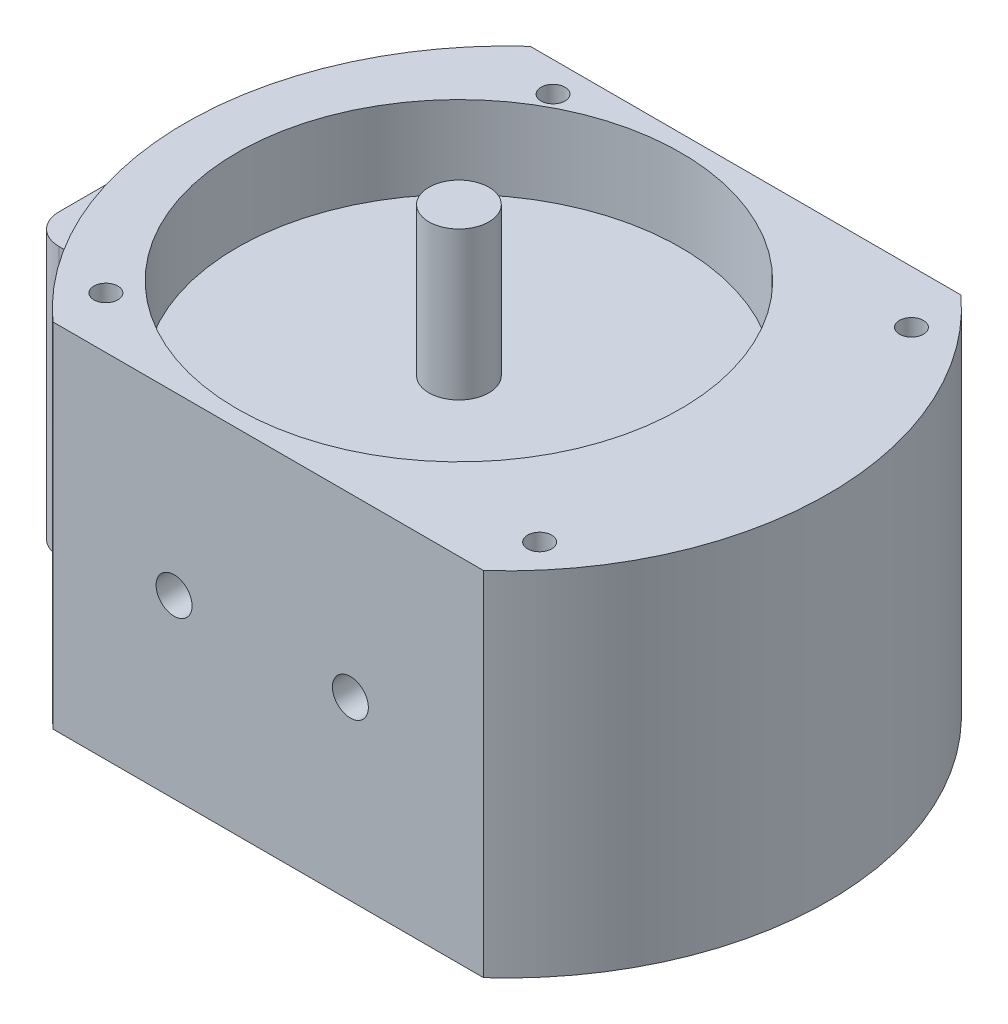
ISO-10303-21;
HEADER;
FILE_DESCRIPTION(('STEP AP214'),'2;1');
FILE_NAME('part.step','',(''),(''),'','','');
FILE_SCHEMA(('AUTOMOTIVE_DESIGN { 1 0 10303 214 1 1 1 1 }'));
ENDSEC;
DATA;
#1=APPLICATION_CONTEXT('core data for automotive mechanical design processes');
#2=APPLICATION_PROTOCOL_DEFINITION('international standard','automotive_design',2000,#1);
#3=PRODUCT_CONTEXT('',#1,'mechanical');
#4=PRODUCT('Part','Part','',(#3));
#5=PRODUCT_RELATED_PRODUCT_CATEGORY('part','',(#4));
#6=PRODUCT_DEFINITION_FORMATION('','',#4);
#7=PRODUCT_DEFINITION_CONTEXT('part definition',#1,'design');
#8=PRODUCT_DEFINITION('design','',#6,#7);
#9=PRODUCT_DEFINITION_SHAPE('','',#8);
#10=(LENGTH_UNIT() NAMED_UNIT(*) SI_UNIT(.MILLI.,.METRE.));
#11=(NAMED_UNIT(*) PLANE_ANGLE_UNIT() SI_UNIT($,.RADIAN.));
#12=(NAMED_UNIT(*) SI_UNIT($,.STERADIAN.) SOLID_ANGLE_UNIT());
#13=UNCERTAINTY_MEASURE_WITH_UNIT(LENGTH_MEASURE(1.E-05),#10,'distance_accuracy_value','');
#14=(GEOMETRIC_REPRESENTATION_CONTEXT(3) GLOBAL_UNCERTAINTY_ASSIGNED_CONTEXT((#13)) GLOBAL_UNIT_ASSIGNED_CONTEXT((#10,
#11,#12)) REPRESENTATION_CONTEXT('',''));
#15=CARTESIAN_POINT('',(0.,0.,0.));
#16=DIRECTION('',(0.,0.,1.));
#17=DIRECTION('',(1.,0.,0.));
#18=AXIS2_PLACEMENT_3D('',#15,#16,#17);
#19=CARTESIAN_POINT('',(-26.15,29.4,-16.5));
#20=DIRECTION('',(0.,0.,1.));
#21=DIRECTION('',(1.,0.,0.));
#22=AXIS2_PLACEMENT_3D('',#19,#20,#21);
#23=PLANE('',#22);
#24=DIRECTION('',(-1.,0.,0.));
#25=VECTOR('',#24,1.);
#26=CARTESIAN_POINT('',(-26.15,22.4,-16.5));
#27=LINE('',#26,#25);
#28=CARTESIAN_POINT('',(-17.1184753237538,22.4,-16.5));
#29=VERTEX_POINT('',#28);
#30=CARTESIAN_POINT('',(-26.15,22.4,-16.5));
#31=VERTEX_POINT('',#30);
#32=EDGE_CURVE('E210',#29,#31,#27,.T.);
#33=ORIENTED_EDGE('',*,*,#32,.F.);
#34=DIRECTION('',(0.,-1.,0.));
#35=VECTOR('',#34,1.);
#36=CARTESIAN_POINT('',(-17.1184753237538,29.4,-16.5));
#37=LINE('',#36,#35);
#38=CARTESIAN_POINT('',(-17.1184753237538,0.,-16.5));
#39=VERTEX_POINT('',#38);
#40=EDGE_CURVE('E136',#29,#39,#37,.T.);
#41=ORIENTED_EDGE('',*,*,#40,.T.);
#42=DIRECTION('',(-1.,0.,0.));
#43=VECTOR('',#42,1.);
#44=CARTESIAN_POINT('',(-26.15,0.,-16.5));
#45=LINE('',#44,#43);
#46=CARTESIAN_POINT('',(-26.15,0.,-16.5));
#47=VERTEX_POINT('',#46);
#48=EDGE_CURVE('E179',#39,#47,#45,.T.);
#49=ORIENTED_EDGE('',*,*,#48,.T.);
#50=DIRECTION('',(0.,-1.,0.));
#51=VECTOR('',#50,1.);
#52=CARTESIAN_POINT('',(-26.15,29.4,-16.5));
#53=LINE('',#52,#51);
#54=EDGE_CURVE('E154',#31,#47,#53,.T.);
#55=ORIENTED_EDGE('',*,*,#54,.F.);
#56=EDGE_LOOP('',(#33,#41,#49,#55));
#57=FACE_BOUND('',#56,.T.);
#58=ADVANCED_FACE('F34',(#57),#23,.F.);
#59=CARTESIAN_POINT('',(-26.15,29.4,-14.));
#60=DIRECTION('',(0.,-1.,0.));
#61=DIRECTION('',(0.,0.,-1.));
#62=AXIS2_PLACEMENT_3D('',#59,#60,#61);
#63=CYLINDRICAL_SURFACE('',#62,2.5);
#64=CARTESIAN_POINT('',(-26.15,22.4,-14.));
#65=DIRECTION('',(0.,1.,0.));
#66=DIRECTION('',(0.,0.,1.));
#67=AXIS2_PLACEMENT_3D('',#64,#65,#66);
#68=CIRCLE('',#67,2.5);
#69=CARTESIAN_POINT('',(-28.65,22.4,-14.));
#70=VERTEX_POINT('',#69);
#71=EDGE_CURVE('E212',#31,#70,#68,.T.);
#72=ORIENTED_EDGE('',*,*,#71,.F.);
#73=ORIENTED_EDGE('',*,*,#54,.T.);
#74=CARTESIAN_POINT('',(-26.15,0.,-14.));
#75=DIRECTION('',(0.,1.,0.));
#76=DIRECTION('',(0.,0.,1.));
#77=AXIS2_PLACEMENT_3D('',#74,#75,#76);
#78=CIRCLE('',#77,2.5);
#79=CARTESIAN_POINT('',(-28.65,0.,-14.));
#80=VERTEX_POINT('',#79);
#81=EDGE_CURVE('E182',#47,#80,#78,.T.);
#82=ORIENTED_EDGE('',*,*,#81,.T.);
#83=DIRECTION('',(0.,-1.,0.));
#84=VECTOR('',#83,1.);
#85=CARTESIAN_POINT('',(-28.65,29.4,-14.));
#86=LINE('',#85,#84);
#87=EDGE_CURVE('E152',#70,#80,#86,.T.);
#88=ORIENTED_EDGE('',*,*,#87,.F.);
#89=EDGE_LOOP('',(#72,#73,#82,#88));
#90=FACE_BOUND('',#89,.T.);
#91=ADVANCED_FACE('F286',(#90),#63,.T.);
#92=CARTESIAN_POINT('',(-28.65,29.4,-14.));
#93=DIRECTION('',(1.,0.,0.));
#94=DIRECTION('',(0.,0.,-1.));
#95=AXIS2_PLACEMENT_3D('',#92,#93,#94);
#96=PLANE('',#95);
#97=DIRECTION('',(0.,0.,1.));
#98=VECTOR('',#97,1.);
#99=CARTESIAN_POINT('',(-28.65,22.4,-14.));
#100=LINE('',#99,#98);
#101=CARTESIAN_POINT('',(-28.65,22.4,4.69999999999998));
#102=VERTEX_POINT('',#101);
#103=EDGE_CURVE('E214',#70,#102,#100,.T.);
#104=ORIENTED_EDGE('',*,*,#103,.F.);
#105=ORIENTED_EDGE('',*,*,#87,.T.);
#106=DIRECTION('',(0.,0.,1.));
#107=VECTOR('',#106,1.);
#108=CARTESIAN_POINT('',(-28.65,0.,-14.));
#109=LINE('',#108,#107);
#110=CARTESIAN_POINT('',(-28.65,0.,4.69999999999998));
#111=VERTEX_POINT('',#110);
#112=EDGE_CURVE('E185',#80,#111,#109,.T.);
#113=ORIENTED_EDGE('',*,*,#112,.T.);
#114=DIRECTION('',(0.,-1.,0.));
#115=VECTOR('',#114,1.);
#116=CARTESIAN_POINT('',(-28.65,29.4,4.69999999999998));
#117=LINE('',#116,#115);
#118=EDGE_CURVE('E145',#102,#111,#117,.T.);
#119=ORIENTED_EDGE('',*,*,#118,.F.);
#120=EDGE_LOOP('',(#104,#105,#113,#119));
#121=FACE_BOUND('',#120,.T.);
#122=ADVANCED_FACE('F292',(#121),#96,.F.);
#123=CARTESIAN_POINT('',(-26.15,29.4,4.7));
#124=DIRECTION('',(0.,-1.,0.));
#125=DIRECTION('',(0.,0.,-1.));
#126=AXIS2_PLACEMENT_3D('',#123,#124,#125);
#127=CYLINDRICAL_SURFACE('',#126,2.5);
#128=CARTESIAN_POINT('',(-26.15,22.4,4.7));
#129=DIRECTION('',(0.,1.,0.));
#130=DIRECTION('',(0.,0.,1.));
#131=AXIS2_PLACEMENT_3D('',#128,#129,#130);
#132=CIRCLE('',#131,2.5);
#133=CARTESIAN_POINT('',(-26.15,22.4,7.2));
#134=VERTEX_POINT('',#133);
#135=EDGE_CURVE('E126',#102,#134,#132,.T.);
#136=ORIENTED_EDGE('',*,*,#135,.F.);
#137=ORIENTED_EDGE('',*,*,#118,.T.);
#138=CARTESIAN_POINT('',(-26.15,0.,4.7));
#139=DIRECTION('',(0.,1.,0.));
#140=DIRECTION('',(0.,0.,-1.));
#141=AXIS2_PLACEMENT_3D('',#138,#139,#140);
#142=CIRCLE('',#141,2.5);
#143=CARTESIAN_POINT('',(-26.15,0.,7.2));
#144=VERTEX_POINT('',#143);
#145=EDGE_CURVE('E188',#111,#144,#142,.T.);
#146=ORIENTED_EDGE('',*,*,#145,.T.);
#147=DIRECTION('',(0.,-1.,0.));
#148=VECTOR('',#147,1.);
#149=CARTESIAN_POINT('',(-26.15,29.4,7.2));
#150=LINE('',#149,#148);
#151=EDGE_CURVE('E142',#134,#144,#150,.T.);
#152=ORIENTED_EDGE('',*,*,#151,.F.);
#153=EDGE_LOOP('',(#136,#137,#146,#152));
#154=FACE_BOUND('',#153,.T.);
#155=ADVANCED_FACE('F327',(#154),#127,.T.);
#156=CARTESIAN_POINT('',(-26.15,29.4,7.2));
#157=DIRECTION('',(0.,0.,-1.));
#158=DIRECTION('',(-1.,0.,0.));
#159=AXIS2_PLACEMENT_3D('',#156,#157,#158);
#160=PLANE('',#159);
#161=DIRECTION('',(1.,0.,0.));
#162=VECTOR('',#161,1.);
#163=CARTESIAN_POINT('',(-26.15,22.4,7.2));
#164=LINE('',#163,#162);
#165=CARTESIAN_POINT('',(-21.8147244804201,22.4,7.2));
#166=VERTEX_POINT('',#165);
#167=EDGE_CURVE('E120',#134,#166,#164,.T.);
#168=ORIENTED_EDGE('',*,*,#167,.F.);
#169=ORIENTED_EDGE('',*,*,#151,.T.);
#170=DIRECTION('',(1.,0.,0.));
#171=VECTOR('',#170,1.);
#172=CARTESIAN_POINT('',(-26.15,0.,7.2));
#173=LINE('',#172,#171);
#174=CARTESIAN_POINT('',(-21.8147244804201,0.,7.2));
#175=VERTEX_POINT('',#174);
#176=EDGE_CURVE('E141',#144,#175,#173,.T.);
#177=ORIENTED_EDGE('',*,*,#176,.T.);
#178=DIRECTION('',(0.,-1.,0.));
#179=VECTOR('',#178,1.);
#180=CARTESIAN_POINT('',(-21.8147244804201,29.4,7.2));
#181=LINE('',#180,#179);
#182=EDGE_CURVE('E133',#166,#175,#181,.T.);
#183=ORIENTED_EDGE('',*,*,#182,.F.);
#184=EDGE_LOOP('',(#168,#169,#177,#183));
#185=FACE_BOUND('',#184,.T.);
#186=ADVANCED_FACE('F139',(#185),#160,.F.);
#187=CARTESIAN_POINT('',(4.,29.4,0.));
#188=DIRECTION('',(0.,-1.,0.));
#189=DIRECTION('',(0.,0.,-1.));
#190=AXIS2_PLACEMENT_3D('',#187,#188,#189);
#191=CYLINDRICAL_SURFACE('',#190,26.8);
#192=CARTESIAN_POINT('',(4.,0.,0.));
#193=DIRECTION('',(0.,1.,0.));
#194=DIRECTION('',(0.,0.,1.));
#195=AXIS2_PLACEMENT_3D('',#192,#193,#194);
#196=CIRCLE('',#195,26.8);
#197=CARTESIAN_POINT('',(21.9507660003689,0.,19.9));
#198=VERTEX_POINT('',#197);
#199=CARTESIAN_POINT('',(21.9507660003689,0.,-19.9));
#200=VERTEX_POINT('',#199);
#201=EDGE_CURVE('E166',#198,#200,#196,.T.);
#202=ORIENTED_EDGE('',*,*,#201,.T.);
#203=DIRECTION('',(0.,-1.,0.));
#204=VECTOR('',#203,1.);
#205=CARTESIAN_POINT('',(21.9507660003689,29.4,-19.9));
#206=LINE('',#205,#204);
#207=CARTESIAN_POINT('',(21.9507660003689,29.4,-19.9));
#208=VERTEX_POINT('',#207);
#209=EDGE_CURVE('E43',#208,#200,#206,.T.);
#210=ORIENTED_EDGE('',*,*,#209,.F.);
#211=CARTESIAN_POINT('',(4.,29.4,0.));
#212=DIRECTION('',(0.,1.,0.));
#213=DIRECTION('',(0.,0.,1.));
#214=AXIS2_PLACEMENT_3D('',#211,#212,#213);
#215=CIRCLE('',#214,26.8);
#216=CARTESIAN_POINT('',(21.9507660003689,29.4,19.9));
#217=VERTEX_POINT('',#216);
#218=EDGE_CURVE('E193',#217,#208,#215,.T.);
#219=ORIENTED_EDGE('',*,*,#218,.F.);
#220=DIRECTION('',(0.,-1.,0.));
#221=VECTOR('',#220,1.);
#222=CARTESIAN_POINT('',(21.9507660003689,29.4,19.9));
#223=LINE('',#222,#221);
#224=EDGE_CURVE('E147',#217,#198,#223,.T.);
#225=ORIENTED_EDGE('',*,*,#224,.T.);
#226=EDGE_LOOP('',(#202,#210,#219,#225));
#227=FACE_BOUND('',#226,.T.);
#228=ADVANCED_FACE('F36',(#227),#191,.T.);
#229=CARTESIAN_POINT('',(-13.9507660003689,29.4,-19.9));
#230=DIRECTION('',(0.,0.,1.));
#231=DIRECTION('',(1.,0.,0.));
#232=AXIS2_PLACEMENT_3D('',#229,#230,#231);
#233=PLANE('',#232);
#234=CARTESIAN_POINT('',(-3.85,14.7,-19.9));
#235=DIRECTION('',(0.,0.,1.));
#236=DIRECTION('',(1.,0.,0.));
#237=AXIS2_PLACEMENT_3D('',#234,#235,#236);
#238=CIRCLE('',#237,1.5);
#239=CARTESIAN_POINT('',(-2.34999999999999,14.7,-19.9));
#240=VERTEX_POINT('',#239);
#241=EDGE_CURVE('E137',#240,#240,#238,.T.);
#242=ORIENTED_EDGE('',*,*,#241,.T.);
#243=EDGE_LOOP('',(#242));
#244=FACE_BOUND('',#243,.T.);
#245=CARTESIAN_POINT('',(10.85,14.7,-19.9));
#246=DIRECTION('',(0.,0.,1.));
#247=DIRECTION('',(1.,0.,0.));
#248=AXIS2_PLACEMENT_3D('',#245,#246,#247);
#249=CIRCLE('',#248,1.5);
#250=CARTESIAN_POINT('',(12.35,14.7,-19.9));
#251=VERTEX_POINT('',#250);
#252=EDGE_CURVE('E220',#251,#251,#249,.T.);
#253=ORIENTED_EDGE('',*,*,#252,.T.);
#254=EDGE_LOOP('',(#253));
#255=FACE_BOUND('',#254,.T.);
#256=DIRECTION('',(-1.,0.,0.));
#257=VECTOR('',#256,1.);
#258=CARTESIAN_POINT('',(-13.9507660003689,0.,-19.9));
#259=LINE('',#258,#257);
#260=CARTESIAN_POINT('',(-13.9507660003689,0.,-19.9));
#261=VERTEX_POINT('',#260);
#262=EDGE_CURVE('E162',#200,#261,#259,.T.);
#263=ORIENTED_EDGE('',*,*,#262,.T.);
#264=DIRECTION('',(0.,-1.,0.));
#265=VECTOR('',#264,1.);
#266=CARTESIAN_POINT('',(-13.9507660003689,29.4,-19.9));
#267=LINE('',#266,#265);
#268=CARTESIAN_POINT('',(-13.9507660003689,29.4,-19.9));
#269=VERTEX_POINT('',#268);
#270=EDGE_CURVE('E157',#269,#261,#267,.T.);
#271=ORIENTED_EDGE('',*,*,#270,.F.);
#272=DIRECTION('',(-1.,0.,0.));
#273=VECTOR('',#272,1.);
#274=CARTESIAN_POINT('',(-13.9507660003689,29.4,-19.9));
#275=LINE('',#274,#273);
#276=EDGE_CURVE('E100',#208,#269,#275,.T.);
#277=ORIENTED_EDGE('',*,*,#276,.F.);
#278=ORIENTED_EDGE('',*,*,#209,.T.);
#279=EDGE_LOOP('',(#263,#271,#277,#278));
#280=FACE_BOUND('',#279,.T.);
#281=ADVANCED_FACE('F161',(#244,#255,#280),#233,.F.);
#282=CARTESIAN_POINT('',(4.,29.4,0.));
#283=DIRECTION('',(0.,-1.,0.));
#284=DIRECTION('',(0.,0.,-1.));
#285=AXIS2_PLACEMENT_3D('',#282,#283,#284);
#286=CYLINDRICAL_SURFACE('',#285,26.8);
#287=DIRECTION('',(0.,-1.,0.));
#288=VECTOR('',#287,1.);
#289=CARTESIAN_POINT('',(-13.9507660003689,29.4,19.9));
#290=LINE('',#289,#288);
#291=CARTESIAN_POINT('',(-13.9507660003689,29.4,19.9));
#292=VERTEX_POINT('',#291);
#293=CARTESIAN_POINT('',(-13.9507660003689,0.,19.9));
#294=VERTEX_POINT('',#293);
#295=EDGE_CURVE('E143',#292,#294,#290,.T.);
#296=ORIENTED_EDGE('',*,*,#295,.F.);
#297=CARTESIAN_POINT('',(4.,29.4,0.));
#298=DIRECTION('',(0.,1.,0.));
#299=DIRECTION('',(0.,0.,1.));
#300=AXIS2_PLACEMENT_3D('',#297,#298,#299);
#301=CIRCLE('',#300,26.8);
#302=EDGE_CURVE('E194',#269,#292,#301,.T.);
#303=ORIENTED_EDGE('',*,*,#302,.F.);
#304=ORIENTED_EDGE('',*,*,#270,.T.);
#305=CARTESIAN_POINT('',(4.,0.,0.));
#306=DIRECTION('',(0.,1.,0.));
#307=DIRECTION('',(0.,0.,1.));
#308=AXIS2_PLACEMENT_3D('',#305,#306,#307);
#309=CIRCLE('',#308,26.8);
#310=EDGE_CURVE('E170',#261,#39,#309,.T.);
#311=ORIENTED_EDGE('',*,*,#310,.T.);
#312=ORIENTED_EDGE('',*,*,#40,.F.);
#313=CARTESIAN_POINT('',(4.,22.4,0.));
#314=DIRECTION('',(0.,-1.,0.));
#315=DIRECTION('',(0.,0.,1.));
#316=AXIS2_PLACEMENT_3D('',#313,#314,#315);
#317=CIRCLE('',#316,26.8);
#318=EDGE_CURVE('E123',#166,#29,#317,.T.);
#319=ORIENTED_EDGE('',*,*,#318,.F.);
#320=ORIENTED_EDGE('',*,*,#182,.T.);
#321=CARTESIAN_POINT('',(4.,0.,0.));
#322=DIRECTION('',(0.,1.,0.));
#323=DIRECTION('',(0.,0.,1.));
#324=AXIS2_PLACEMENT_3D('',#321,#322,#323);
#325=CIRCLE('',#324,26.8);
#326=EDGE_CURVE('E86',#175,#294,#325,.T.);
#327=ORIENTED_EDGE('',*,*,#326,.T.);
#328=EDGE_LOOP('',(#296,#303,#304,#311,#312,#319,#320,#327));
#329=FACE_BOUND('',#328,.T.);
#330=ADVANCED_FACE('F132',(#329),#286,.T.);
#331=CARTESIAN_POINT('',(-13.9507660003689,29.4,19.9));
#332=DIRECTION('',(0.,0.,-1.));
#333=DIRECTION('',(-1.,0.,0.));
#334=AXIS2_PLACEMENT_3D('',#331,#332,#333);
#335=PLANE('',#334);
#336=CARTESIAN_POINT('',(-3.85,14.7,19.9));
#337=DIRECTION('',(0.,0.,1.));
#338=DIRECTION('',(1.,0.,0.));
#339=AXIS2_PLACEMENT_3D('',#336,#337,#338);
#340=CIRCLE('',#339,1.5);
#341=CARTESIAN_POINT('',(-2.34999999999999,14.7,19.9));
#342=VERTEX_POINT('',#341);
#343=EDGE_CURVE('E224',#342,#342,#340,.T.);
#344=ORIENTED_EDGE('',*,*,#343,.F.);
#345=EDGE_LOOP('',(#344));
#346=FACE_BOUND('',#345,.T.);
#347=CARTESIAN_POINT('',(10.85,14.7,19.9));
#348=DIRECTION('',(0.,0.,1.));
#349=DIRECTION('',(1.,0.,0.));
#350=AXIS2_PLACEMENT_3D('',#347,#348,#349);
#351=CIRCLE('',#350,1.5);
#352=CARTESIAN_POINT('',(12.35,14.7,19.9));
#353=VERTEX_POINT('',#352);
#354=EDGE_CURVE('E217',#353,#353,#351,.T.);
#355=ORIENTED_EDGE('',*,*,#354,.F.);
#356=EDGE_LOOP('',(#355));
#357=FACE_BOUND('',#356,.T.);
#358=DIRECTION('',(1.,0.,0.));
#359=VECTOR('',#358,1.);
#360=CARTESIAN_POINT('',(-13.9507660003689,0.,19.9));
#361=LINE('',#360,#359);
#362=EDGE_CURVE('E92',#294,#198,#361,.T.);
#363=ORIENTED_EDGE('',*,*,#362,.T.);
#364=ORIENTED_EDGE('',*,*,#224,.F.);
#365=DIRECTION('',(1.,0.,0.));
#366=VECTOR('',#365,1.);
#367=CARTESIAN_POINT('',(-13.9507660003689,29.4,19.9));
#368=LINE('',#367,#366);
#369=EDGE_CURVE('E51',#292,#217,#368,.T.);
#370=ORIENTED_EDGE('',*,*,#369,.F.);
#371=ORIENTED_EDGE('',*,*,#295,.T.);
#372=EDGE_LOOP('',(#363,#364,#370,#371));
#373=FACE_BOUND('',#372,.T.);
#374=ADVANCED_FACE('F302',(#346,#357,#373),#335,.F.);
#375=CARTESIAN_POINT('',(4.,29.4,0.));
#376=DIRECTION('',(0.,1.,0.));
#377=DIRECTION('',(0.,0.,1.));
#378=AXIS2_PLACEMENT_3D('',#375,#376,#377);
#379=PLANE('',#378);
#380=CARTESIAN_POINT('',(-13.8333835340455,29.4,15.6));
#381=DIRECTION('',(0.,1.,0.));
#382=DIRECTION('',(0.,0.,1.));
#383=AXIS2_PLACEMENT_3D('',#380,#381,#382);
#384=CIRCLE('',#383,1.);
#385=CARTESIAN_POINT('',(-13.8333835340455,29.4,16.6));
#386=VERTEX_POINT('',#385);
#387=EDGE_CURVE('E221',#386,#386,#384,.T.);
#388=ORIENTED_EDGE('',*,*,#387,.F.);
#389=EDGE_LOOP('',(#388));
#390=FACE_BOUND('',#389,.T.);
#391=CARTESIAN_POINT('',(22.2297098496587,29.4,15.4999999999995));
#392=DIRECTION('',(0.,1.,0.));
#393=DIRECTION('',(0.,0.,1.));
#394=AXIS2_PLACEMENT_3D('',#391,#392,#393);
#395=CIRCLE('',#394,0.99999999999983);
#396=CARTESIAN_POINT('',(22.2297098496587,29.4,16.4999999999994));
#397=VERTEX_POINT('',#396);
#398=EDGE_CURVE('E231',#397,#397,#395,.T.);
#399=ORIENTED_EDGE('',*,*,#398,.F.);
#400=EDGE_LOOP('',(#399));
#401=FACE_BOUND('',#400,.T.);
#402=CARTESIAN_POINT('',(22.2297098496575,29.4,-15.5000000000014));
#403=DIRECTION('',(0.,1.,0.));
#404=DIRECTION('',(0.,0.,1.));
#405=AXIS2_PLACEMENT_3D('',#402,#403,#404);
#406=CIRCLE('',#405,1.);
#407=CARTESIAN_POINT('',(22.2297098496575,29.4,-14.5000000000014));
#408=VERTEX_POINT('',#407);
#409=EDGE_CURVE('E234',#408,#408,#406,.T.);
#410=ORIENTED_EDGE('',*,*,#409,.F.);
#411=EDGE_LOOP('',(#410));
#412=FACE_BOUND('',#411,.T.);
#413=CARTESIAN_POINT('',(-9.55314084476933,29.4,-17.4));
#414=DIRECTION('',(0.,1.,0.));
#415=DIRECTION('',(0.,0.,1.));
#416=AXIS2_PLACEMENT_3D('',#413,#414,#415);
#417=CIRCLE('',#416,1.);
#418=CARTESIAN_POINT('',(-9.55314084476933,29.4,-16.4));
#419=VERTEX_POINT('',#418);
#420=EDGE_CURVE('E237',#419,#419,#417,.T.);
#421=ORIENTED_EDGE('',*,*,#420,.F.);
#422=EDGE_LOOP('',(#421));
#423=FACE_BOUND('',#422,.T.);
#424=ORIENTED_EDGE('',*,*,#302,.T.);
#425=ORIENTED_EDGE('',*,*,#369,.T.);
#426=ORIENTED_EDGE('',*,*,#218,.T.);
#427=ORIENTED_EDGE('',*,*,#276,.T.);
#428=EDGE_LOOP('',(#424,#425,#426,#427));
#429=FACE_BOUND('',#428,.T.);
#430=CARTESIAN_POINT('',(0.,29.4,0.));
#431=DIRECTION('',(0.,1.,0.));
#432=DIRECTION('',(0.,0.,1.));
#433=AXIS2_PLACEMENT_3D('',#430,#431,#432);
#434=CIRCLE('',#433,18.5);
#435=CARTESIAN_POINT('',(0.,29.4,18.5));
#436=VERTEX_POINT('',#435);
#437=EDGE_CURVE('E173',#436,#436,#434,.T.);
#438=ORIENTED_EDGE('',*,*,#437,.F.);
#439=EDGE_LOOP('',(#438));
#440=FACE_BOUND('',#439,.T.);
#441=ADVANCED_FACE('F259',(#390,#401,#412,#423,#429,#440),#379,.T.);
#442=CARTESIAN_POINT('',(4.,0.,0.));
#443=DIRECTION('',(0.,1.,0.));
#444=DIRECTION('',(0.,0.,1.));
#445=AXIS2_PLACEMENT_3D('',#442,#443,#444);
#446=PLANE('',#445);
#447=CARTESIAN_POINT('',(-13.8333835340455,0.,15.6));
#448=DIRECTION('',(0.,-1.,0.));
#449=DIRECTION('',(0.,0.,-1.));
#450=AXIS2_PLACEMENT_3D('',#447,#448,#449);
#451=CIRCLE('',#450,1.);
#452=CARTESIAN_POINT('',(-13.8333835340455,0.,14.6));
#453=VERTEX_POINT('',#452);
#454=EDGE_CURVE('E240',#453,#453,#451,.T.);
#455=ORIENTED_EDGE('',*,*,#454,.F.);
#456=EDGE_LOOP('',(#455));
#457=FACE_BOUND('',#456,.T.);
#458=CARTESIAN_POINT('',(22.2297098496587,0.,15.4999999999995));
#459=DIRECTION('',(0.,-1.,0.));
#460=DIRECTION('',(0.,0.,-1.));
#461=AXIS2_PLACEMENT_3D('',#458,#459,#460);
#462=CIRCLE('',#461,0.99999999999983);
#463=CARTESIAN_POINT('',(22.2297098496587,0.,14.4999999999997));
#464=VERTEX_POINT('',#463);
#465=EDGE_CURVE('E247',#464,#464,#462,.T.);
#466=ORIENTED_EDGE('',*,*,#465,.F.);
#467=EDGE_LOOP('',(#466));
#468=FACE_BOUND('',#467,.T.);
#469=CARTESIAN_POINT('',(22.2297098496575,0.,-15.5000000000014));
#470=DIRECTION('',(0.,-1.,0.));
#471=DIRECTION('',(0.,0.,-1.));
#472=AXIS2_PLACEMENT_3D('',#469,#470,#471);
#473=CIRCLE('',#472,1.);
#474=CARTESIAN_POINT('',(22.2297098496575,0.,-16.5000000000014));
#475=VERTEX_POINT('',#474);
#476=EDGE_CURVE('E244',#475,#475,#473,.T.);
#477=ORIENTED_EDGE('',*,*,#476,.F.);
#478=EDGE_LOOP('',(#477));
#479=FACE_BOUND('',#478,.T.);
#480=CARTESIAN_POINT('',(-9.55314084476933,0.,-17.4));
#481=DIRECTION('',(0.,-1.,0.));
#482=DIRECTION('',(0.,0.,-1.));
#483=AXIS2_PLACEMENT_3D('',#480,#481,#482);
#484=CIRCLE('',#483,1.);
#485=CARTESIAN_POINT('',(-9.55314084476933,0.,-18.4));
#486=VERTEX_POINT('',#485);
#487=EDGE_CURVE('E241',#486,#486,#484,.T.);
#488=ORIENTED_EDGE('',*,*,#487,.F.);
#489=EDGE_LOOP('',(#488));
#490=FACE_BOUND('',#489,.T.);
#491=CARTESIAN_POINT('',(0.,0.,0.));
#492=DIRECTION('',(0.,1.,0.));
#493=DIRECTION('',(0.,0.,1.));
#494=AXIS2_PLACEMENT_3D('',#491,#492,#493);
#495=CIRCLE('',#494,2.85);
#496=CARTESIAN_POINT('',(0.,0.,2.85));
#497=VERTEX_POINT('',#496);
#498=EDGE_CURVE('E11',#497,#497,#495,.F.);
#499=ORIENTED_EDGE('',*,*,#498,.F.);
#500=EDGE_LOOP('',(#499));
#501=FACE_BOUND('',#500,.T.);
#502=ORIENTED_EDGE('',*,*,#201,.F.);
#503=ORIENTED_EDGE('',*,*,#362,.F.);
#504=ORIENTED_EDGE('',*,*,#326,.F.);
#505=ORIENTED_EDGE('',*,*,#176,.F.);
#506=ORIENTED_EDGE('',*,*,#145,.F.);
#507=ORIENTED_EDGE('',*,*,#112,.F.);
#508=ORIENTED_EDGE('',*,*,#81,.F.);
#509=ORIENTED_EDGE('',*,*,#48,.F.);
#510=ORIENTED_EDGE('',*,*,#310,.F.);
#511=ORIENTED_EDGE('',*,*,#262,.F.);
#512=EDGE_LOOP('',(#502,#503,#504,#505,#506,#507,#508,#509,#510,#511));
#513=FACE_BOUND('',#512,.T.);
#514=ADVANCED_FACE('F255',(#457,#468,#479,#490,#501,#513),#446,.F.);
#515=CARTESIAN_POINT('',(0.,22.55,0.));
#516=DIRECTION('',(0.,1.,0.));
#517=DIRECTION('',(0.,0.,1.));
#518=AXIS2_PLACEMENT_3D('',#515,#516,#517);
#519=CYLINDRICAL_SURFACE('',#518,18.5);
#520=CARTESIAN_POINT('',(0.,22.55,0.));
#521=DIRECTION('',(0.,1.,0.));
#522=DIRECTION('',(0.,0.,1.));
#523=AXIS2_PLACEMENT_3D('',#520,#521,#522);
#524=CIRCLE('',#523,18.5);
#525=CARTESIAN_POINT('',(0.,22.55,18.5));
#526=VERTEX_POINT('',#525);
#527=EDGE_CURVE('E168',#526,#526,#524,.T.);
#528=ORIENTED_EDGE('',*,*,#527,.F.);
#529=EDGE_LOOP('',(#528));
#530=FACE_BOUND('',#529,.T.);
#531=ORIENTED_EDGE('',*,*,#437,.T.);
#532=EDGE_LOOP('',(#531));
#533=FACE_BOUND('',#532,.T.);
#534=ADVANCED_FACE('F258',(#530,#533),#519,.F.);
#535=CARTESIAN_POINT('',(0.,22.55,0.));
#536=DIRECTION('',(0.,1.,0.));
#537=DIRECTION('',(0.,0.,1.));
#538=AXIS2_PLACEMENT_3D('',#535,#536,#537);
#539=PLANE('',#538);
#540=CARTESIAN_POINT('',(0.,22.55,0.));
#541=DIRECTION('',(0.,1.,0.));
#542=DIRECTION('',(0.,0.,1.));
#543=AXIS2_PLACEMENT_3D('',#540,#541,#542);
#544=CIRCLE('',#543,2.5);
#545=CARTESIAN_POINT('',(0.,22.55,2.5));
#546=VERTEX_POINT('',#545);
#547=EDGE_CURVE('E202',#546,#546,#544,.T.);
#548=ORIENTED_EDGE('',*,*,#547,.F.);
#549=EDGE_LOOP('',(#548));
#550=FACE_BOUND('',#549,.T.);
#551=ORIENTED_EDGE('',*,*,#527,.T.);
#552=EDGE_LOOP('',(#551));
#553=FACE_BOUND('',#552,.T.);
#554=ADVANCED_FACE('F348',(#550,#553),#539,.T.);
#555=CARTESIAN_POINT('',(0.,34.9,0.));
#556=DIRECTION('',(0.,-1.,0.));
#557=DIRECTION('',(0.,0.,-1.));
#558=AXIS2_PLACEMENT_3D('',#555,#556,#557);
#559=CYLINDRICAL_SURFACE('',#558,2.5);
#560=CARTESIAN_POINT('',(0.,34.9,0.));
#561=DIRECTION('',(0.,1.,0.));
#562=DIRECTION('',(0.,0.,1.));
#563=AXIS2_PLACEMENT_3D('',#560,#561,#562);
#564=CIRCLE('',#563,2.5);
#565=CARTESIAN_POINT('',(0.,34.9,2.5));
#566=VERTEX_POINT('',#565);
#567=EDGE_CURVE('E200',#566,#566,#564,.T.);
#568=ORIENTED_EDGE('',*,*,#567,.F.);
#569=EDGE_LOOP('',(#568));
#570=FACE_BOUND('',#569,.T.);
#571=ORIENTED_EDGE('',*,*,#547,.T.);
#572=EDGE_LOOP('',(#571));
#573=FACE_BOUND('',#572,.T.);
#574=ADVANCED_FACE('F281',(#570,#573),#559,.T.);
#575=CARTESIAN_POINT('',(0.,34.9,0.));
#576=DIRECTION('',(0.,1.,0.));
#577=DIRECTION('',(0.,0.,1.));
#578=AXIS2_PLACEMENT_3D('',#575,#576,#577);
#579=PLANE('',#578);
#580=ORIENTED_EDGE('',*,*,#567,.T.);
#581=EDGE_LOOP('',(#580));
#582=FACE_BOUND('',#581,.T.);
#583=ADVANCED_FACE('F272',(#582),#579,.T.);
#584=CARTESIAN_POINT('',(0.,-4.,0.));
#585=DIRECTION('',(0.,1.,0.));
#586=DIRECTION('',(0.,0.,1.));
#587=AXIS2_PLACEMENT_3D('',#584,#585,#586);
#588=CYLINDRICAL_SURFACE('',#587,2.85);
#589=CARTESIAN_POINT('',(0.,-4.,0.));
#590=DIRECTION('',(0.,-1.,0.));
#591=DIRECTION('',(0.,0.,-1.));
#592=AXIS2_PLACEMENT_3D('',#589,#590,#591);
#593=CIRCLE('',#592,2.85);
#594=CARTESIAN_POINT('',(0.,-4.,-2.85));
#595=VERTEX_POINT('',#594);
#596=EDGE_CURVE('E205',#595,#595,#593,.T.);
#597=ORIENTED_EDGE('',*,*,#596,.F.);
#598=EDGE_LOOP('',(#597));
#599=FACE_BOUND('',#598,.T.);
#600=ORIENTED_EDGE('',*,*,#498,.T.);
#601=EDGE_LOOP('',(#600));
#602=FACE_BOUND('',#601,.T.);
#603=ADVANCED_FACE('F269',(#599,#602),#588,.T.);
#604=CARTESIAN_POINT('',(0.,-4.,0.));
#605=DIRECTION('',(0.,-1.,0.));
#606=DIRECTION('',(0.,0.,-1.));
#607=AXIS2_PLACEMENT_3D('',#604,#605,#606);
#608=PLANE('',#607);
#609=ORIENTED_EDGE('',*,*,#596,.T.);
#610=EDGE_LOOP('',(#609));
#611=FACE_BOUND('',#610,.T.);
#612=ADVANCED_FACE('F271',(#611),#608,.T.);
#613=CARTESIAN_POINT('',(4.,22.4,0.));
#614=DIRECTION('',(0.,1.,0.));
#615=DIRECTION('',(0.,0.,1.));
#616=AXIS2_PLACEMENT_3D('',#613,#614,#615);
#617=PLANE('',#616);
#618=ORIENTED_EDGE('',*,*,#32,.T.);
#619=ORIENTED_EDGE('',*,*,#71,.T.);
#620=ORIENTED_EDGE('',*,*,#103,.T.);
#621=ORIENTED_EDGE('',*,*,#135,.T.);
#622=ORIENTED_EDGE('',*,*,#167,.T.);
#623=ORIENTED_EDGE('',*,*,#318,.T.);
#624=EDGE_LOOP('',(#618,#619,#620,#621,#622,#623));
#625=FACE_BOUND('',#624,.T.);
#626=ADVANCED_FACE('F122',(#625),#617,.T.);
#627=CARTESIAN_POINT('',(10.85,14.7,-19.9));
#628=DIRECTION('',(0.,0.,1.));
#629=DIRECTION('',(1.,0.,0.));
#630=AXIS2_PLACEMENT_3D('',#627,#628,#629);
#631=CYLINDRICAL_SURFACE('',#630,1.5);
#632=ORIENTED_EDGE('',*,*,#252,.F.);
#633=EDGE_LOOP('',(#632));
#634=FACE_BOUND('',#633,.T.);
#635=ORIENTED_EDGE('',*,*,#354,.T.);
#636=EDGE_LOOP('',(#635));
#637=FACE_BOUND('',#636,.T.);
#638=ADVANCED_FACE('F308',(#634,#637),#631,.F.);
#639=CARTESIAN_POINT('',(-3.85,14.7,-19.9));
#640=DIRECTION('',(0.,0.,1.));
#641=DIRECTION('',(1.,0.,0.));
#642=AXIS2_PLACEMENT_3D('',#639,#640,#641);
#643=CYLINDRICAL_SURFACE('',#642,1.5);
#644=ORIENTED_EDGE('',*,*,#241,.F.);
#645=EDGE_LOOP('',(#644));
#646=FACE_BOUND('',#645,.T.);
#647=ORIENTED_EDGE('',*,*,#343,.T.);
#648=EDGE_LOOP('',(#647));
#649=FACE_BOUND('',#648,.T.);
#650=ADVANCED_FACE('F311',(#646,#649),#643,.F.);
#651=CARTESIAN_POINT('',(-9.55314084476933,34.9,-17.4));
#652=DIRECTION('',(0.,-1.,0.));
#653=DIRECTION('',(0.,0.,-1.));
#654=AXIS2_PLACEMENT_3D('',#651,#652,#653);
#655=CYLINDRICAL_SURFACE('',#654,1.);
#656=ORIENTED_EDGE('',*,*,#420,.T.);
#657=EDGE_LOOP('',(#656));
#658=FACE_BOUND('',#657,.T.);
#659=ORIENTED_EDGE('',*,*,#487,.T.);
#660=EDGE_LOOP('',(#659));
#661=FACE_BOUND('',#660,.T.);
#662=ADVANCED_FACE('F449',(#658,#661),#655,.F.);
#663=CARTESIAN_POINT('',(22.2297098496575,34.9,-15.5000000000014));
#664=DIRECTION('',(0.,-1.,0.));
#665=DIRECTION('',(0.,0.,-1.));
#666=AXIS2_PLACEMENT_3D('',#663,#664,#665);
#667=CYLINDRICAL_SURFACE('',#666,1.);
#668=ORIENTED_EDGE('',*,*,#409,.T.);
#669=EDGE_LOOP('',(#668));
#670=FACE_BOUND('',#669,.T.);
#671=ORIENTED_EDGE('',*,*,#476,.T.);
#672=EDGE_LOOP('',(#671));
#673=FACE_BOUND('',#672,.T.);
#674=ADVANCED_FACE('F471',(#670,#673),#667,.F.);
#675=CARTESIAN_POINT('',(22.2297098496587,34.9,15.4999999999995));
#676=DIRECTION('',(0.,-1.,0.));
#677=DIRECTION('',(0.,0.,-1.));
#678=AXIS2_PLACEMENT_3D('',#675,#676,#677);
#679=CYLINDRICAL_SURFACE('',#678,0.99999999999983);
#680=ORIENTED_EDGE('',*,*,#398,.T.);
#681=EDGE_LOOP('',(#680));
#682=FACE_BOUND('',#681,.T.);
#683=ORIENTED_EDGE('',*,*,#465,.T.);
#684=EDGE_LOOP('',(#683));
#685=FACE_BOUND('',#684,.T.);
#686=ADVANCED_FACE('F481',(#682,#685),#679,.F.);
#687=CARTESIAN_POINT('',(-13.8333835340455,34.9,15.6));
#688=DIRECTION('',(0.,-1.,0.));
#689=DIRECTION('',(0.,0.,-1.));
#690=AXIS2_PLACEMENT_3D('',#687,#688,#689);
#691=CYLINDRICAL_SURFACE('',#690,1.);
#692=ORIENTED_EDGE('',*,*,#387,.T.);
#693=EDGE_LOOP('',(#692));
#694=FACE_BOUND('',#693,.T.);
#695=ORIENTED_EDGE('',*,*,#454,.T.);
#696=EDGE_LOOP('',(#695));
#697=FACE_BOUND('',#696,.T.);
#698=ADVANCED_FACE('F253',(#694,#697),#691,.F.);
#699=CLOSED_SHELL('',(#58,#91,#122,#155,#186,#228,#281,#330,#374,#441,#514,#534,#554,#574,#583,
#603,#612,#626,#638,#650,#662,#674,#686,#698));
#700=MANIFOLD_SOLID_BREP('B2',#699);
#701=ADVANCED_BREP_SHAPE_REPRESENTATION('',(#18,#700),#14);
#702=SHAPE_DEFINITION_REPRESENTATION(#9,#701);
ENDSEC;
END-ISO-10303-21;
